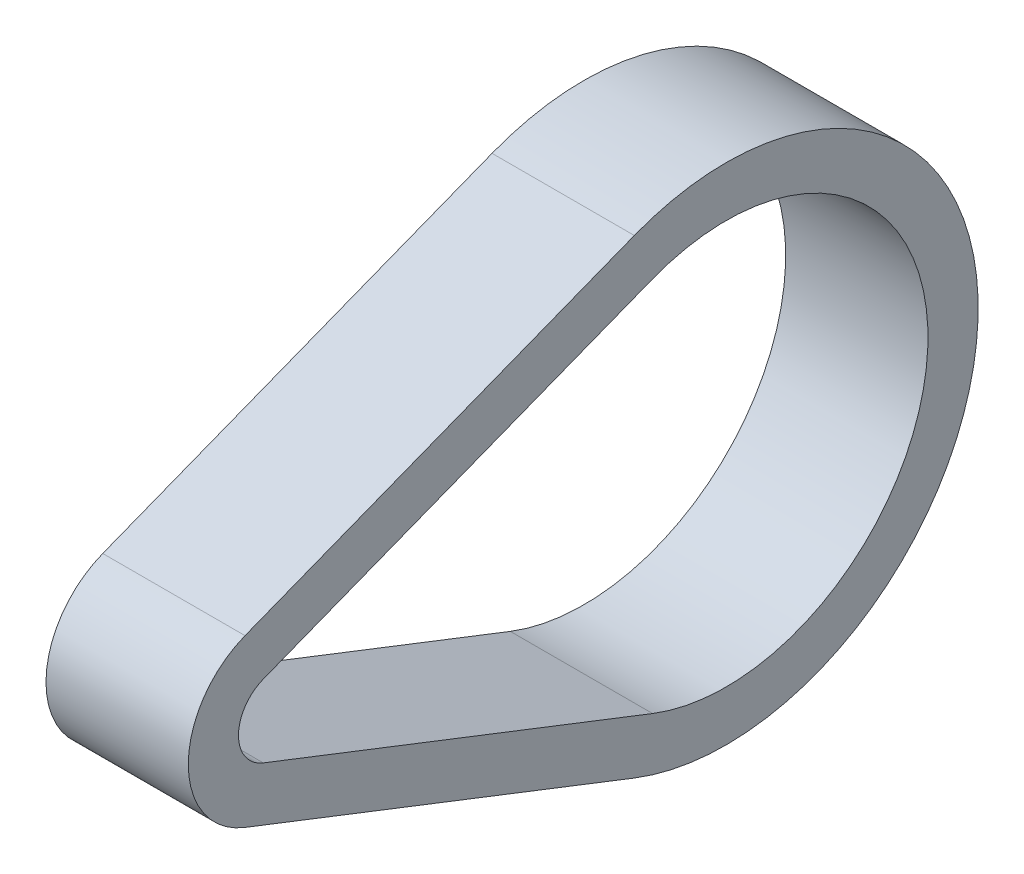
ISO-10303-21;
HEADER;
FILE_DESCRIPTION(('STEP AP214'),'2;1');
FILE_NAME('part.step','',(''),(''),'','','');
FILE_SCHEMA(('AUTOMOTIVE_DESIGN { 1 0 10303 214 1 1 1 1 }'));
ENDSEC;
DATA;
#1=APPLICATION_CONTEXT('core data for automotive mechanical design processes');
#2=APPLICATION_PROTOCOL_DEFINITION('international standard','automotive_design',2000,#1);
#3=PRODUCT_CONTEXT('',#1,'mechanical');
#4=PRODUCT('Part','Part','',(#3));
#5=PRODUCT_RELATED_PRODUCT_CATEGORY('part','',(#4));
#6=PRODUCT_DEFINITION_FORMATION('','',#4);
#7=PRODUCT_DEFINITION_CONTEXT('part definition',#1,'design');
#8=PRODUCT_DEFINITION('design','',#6,#7);
#9=PRODUCT_DEFINITION_SHAPE('','',#8);
#10=(LENGTH_UNIT() NAMED_UNIT(*) SI_UNIT(.MILLI.,.METRE.));
#11=(NAMED_UNIT(*) PLANE_ANGLE_UNIT() SI_UNIT($,.RADIAN.));
#12=(NAMED_UNIT(*) SI_UNIT($,.STERADIAN.) SOLID_ANGLE_UNIT());
#13=UNCERTAINTY_MEASURE_WITH_UNIT(LENGTH_MEASURE(1.E-05),#10,'distance_accuracy_value','');
#14=(GEOMETRIC_REPRESENTATION_CONTEXT(3) GLOBAL_UNCERTAINTY_ASSIGNED_CONTEXT((#13)) GLOBAL_UNIT_ASSIGNED_CONTEXT((#10,
#11,#12)) REPRESENTATION_CONTEXT('',''));
#15=CARTESIAN_POINT('',(0.,0.,0.));
#16=DIRECTION('',(0.,0.,1.));
#17=DIRECTION('',(1.,0.,0.));
#18=AXIS2_PLACEMENT_3D('',#15,#16,#17);
#19=CARTESIAN_POINT('',(4.5,0.,0.));
#20=DIRECTION('',(1.,0.,0.));
#21=DIRECTION('',(0.,0.,-1.));
#22=AXIS2_PLACEMENT_3D('',#19,#20,#21);
#23=PLANE('',#22);
#24=CARTESIAN_POINT('',(4.5,0.,0.));
#25=DIRECTION('',(1.,0.,0.));
#26=DIRECTION('',(0.,0.,-1.));
#27=AXIS2_PLACEMENT_3D('',#24,#25,#26);
#28=CIRCLE('',#27,5.6388);
#29=CARTESIAN_POINT('',(4.5,5.25313146964657,2.04955487914056));
#30=VERTEX_POINT('',#29);
#31=CARTESIAN_POINT('',(4.5,-5.25313146964657,2.04955487914055));
#32=VERTEX_POINT('',#31);
#33=EDGE_CURVE('E153',#30,#32,#28,.T.);
#34=ORIENTED_EDGE('',*,*,#33,.T.);
#35=DIRECTION('',(0.,-0.363473589973142,-0.931604502668399));
#36=VECTOR('',#35,1.);
#37=CARTESIAN_POINT('',(4.5,-5.25313146964657,2.04955487914055));
#38=LINE('',#37,#36);
#39=CARTESIAN_POINT('',(4.5,-14.8602097429642,-22.5739600716204));
#40=VERTEX_POINT('',#39);
#41=EDGE_CURVE('E157',#32,#40,#38,.T.);
#42=ORIENTED_EDGE('',*,*,#41,.T.);
#43=CARTESIAN_POINT('',(4.5,0.,-28.3718));
#44=DIRECTION('',(1.,0.,0.));
#45=DIRECTION('',(0.,0.,-1.));
#46=AXIS2_PLACEMENT_3D('',#43,#44,#45);
#47=CIRCLE('',#46,15.9512);
#48=CARTESIAN_POINT('',(4.5,14.8602097429642,-22.5739600716204));
#49=VERTEX_POINT('',#48);
#50=EDGE_CURVE('E161',#40,#49,#47,.T.);
#51=ORIENTED_EDGE('',*,*,#50,.T.);
#52=DIRECTION('',(0.,-0.363473589973142,0.9316045026684));
#53=VECTOR('',#52,1.);
#54=CARTESIAN_POINT('',(4.5,5.25313146964657,2.04955487914056));
#55=LINE('',#54,#53);
#56=EDGE_CURVE('E164',#49,#30,#55,.T.);
#57=ORIENTED_EDGE('',*,*,#56,.T.);
#58=EDGE_LOOP('',(#34,#42,#51,#57));
#59=FACE_BOUND('',#58,.T.);
#60=DIRECTION('',(0.,-0.363473589973142,-0.9316045026684));
#61=VECTOR('',#60,1.);
#62=CARTESIAN_POINT('',(4.5,-2.2952871736744,0.895526230975828));
#63=LINE('',#62,#61);
#64=CARTESIAN_POINT('',(4.5,-2.2952871736744,0.895526230975828));
#65=VERTEX_POINT('',#64);
#66=CARTESIAN_POINT('',(4.5,-11.902365446992,-23.7279887197851));
#67=VERTEX_POINT('',#66);
#68=EDGE_CURVE('E114',#65,#67,#63,.T.);
#69=ORIENTED_EDGE('',*,*,#68,.F.);
#70=CARTESIAN_POINT('',(4.5,0.,0.));
#71=DIRECTION('',(1.,0.,0.));
#72=DIRECTION('',(0.,0.,-1.));
#73=AXIS2_PLACEMENT_3D('',#70,#71,#72);
#74=CIRCLE('',#73,2.4638);
#75=CARTESIAN_POINT('',(4.5,2.2952871736744,0.895526230975828));
#76=VERTEX_POINT('',#75);
#77=EDGE_CURVE('E105',#76,#65,#74,.T.);
#78=ORIENTED_EDGE('',*,*,#77,.F.);
#79=DIRECTION('',(0.,-0.363473589973142,0.9316045026684));
#80=VECTOR('',#79,1.);
#81=CARTESIAN_POINT('',(4.5,2.2952871736744,0.895526230975828));
#82=LINE('',#81,#80);
#83=CARTESIAN_POINT('',(4.5,11.902365446992,-23.7279887197851));
#84=VERTEX_POINT('',#83);
#85=EDGE_CURVE('E131',#84,#76,#82,.T.);
#86=ORIENTED_EDGE('',*,*,#85,.F.);
#87=CARTESIAN_POINT('',(4.5,0.,-28.3718));
#88=DIRECTION('',(1.,0.,0.));
#89=DIRECTION('',(0.,0.,-1.));
#90=AXIS2_PLACEMENT_3D('',#87,#88,#89);
#91=CIRCLE('',#90,12.7762);
#92=EDGE_CURVE('E127',#67,#84,#91,.T.);
#93=ORIENTED_EDGE('',*,*,#92,.F.);
#94=EDGE_LOOP('',(#69,#78,#86,#93));
#95=FACE_BOUND('',#94,.T.);
#96=ADVANCED_FACE('F39',(#59,#95),#23,.T.);
#97=CARTESIAN_POINT('',(-4.5,0.,0.));
#98=DIRECTION('',(1.,0.,0.));
#99=DIRECTION('',(0.,0.,-1.));
#100=AXIS2_PLACEMENT_3D('',#97,#98,#99);
#101=PLANE('',#100);
#102=CARTESIAN_POINT('',(-4.5,0.,0.));
#103=DIRECTION('',(1.,0.,0.));
#104=DIRECTION('',(0.,0.,-1.));
#105=AXIS2_PLACEMENT_3D('',#102,#103,#104);
#106=CIRCLE('',#105,5.6388);
#107=CARTESIAN_POINT('',(-4.5,5.25313146964657,2.04955487914056));
#108=VERTEX_POINT('',#107);
#109=CARTESIAN_POINT('',(-4.5,-5.25313146964657,2.04955487914055));
#110=VERTEX_POINT('',#109);
#111=EDGE_CURVE('E123',#108,#110,#106,.T.);
#112=ORIENTED_EDGE('',*,*,#111,.F.);
#113=DIRECTION('',(0.,-0.363473589973142,0.9316045026684));
#114=VECTOR('',#113,1.);
#115=CARTESIAN_POINT('',(-4.5,5.25313146964657,2.04955487914056));
#116=LINE('',#115,#114);
#117=CARTESIAN_POINT('',(-4.5,14.8602097429642,-22.5739600716204));
#118=VERTEX_POINT('',#117);
#119=EDGE_CURVE('E158',#118,#108,#116,.T.);
#120=ORIENTED_EDGE('',*,*,#119,.F.);
#121=CARTESIAN_POINT('',(-4.5,0.,-28.3718));
#122=DIRECTION('',(1.,0.,0.));
#123=DIRECTION('',(0.,0.,-1.));
#124=AXIS2_PLACEMENT_3D('',#121,#122,#123);
#125=CIRCLE('',#124,15.9512);
#126=CARTESIAN_POINT('',(-4.5,-14.8602097429642,-22.5739600716204));
#127=VERTEX_POINT('',#126);
#128=EDGE_CURVE('E174',#127,#118,#125,.T.);
#129=ORIENTED_EDGE('',*,*,#128,.F.);
#130=DIRECTION('',(0.,-0.363473589973142,-0.931604502668399));
#131=VECTOR('',#130,1.);
#132=CARTESIAN_POINT('',(-4.5,-5.25313146964657,2.04955487914055));
#133=LINE('',#132,#131);
#134=EDGE_CURVE('E171',#110,#127,#133,.T.);
#135=ORIENTED_EDGE('',*,*,#134,.F.);
#136=EDGE_LOOP('',(#112,#120,#129,#135));
#137=FACE_BOUND('',#136,.T.);
#138=CARTESIAN_POINT('',(-4.5,0.,0.));
#139=DIRECTION('',(1.,0.,0.));
#140=DIRECTION('',(0.,0.,-1.));
#141=AXIS2_PLACEMENT_3D('',#138,#139,#140);
#142=CIRCLE('',#141,2.4638);
#143=CARTESIAN_POINT('',(-4.5,2.2952871736744,0.895526230975828));
#144=VERTEX_POINT('',#143);
#145=CARTESIAN_POINT('',(-4.5,-2.2952871736744,0.895526230975828));
#146=VERTEX_POINT('',#145);
#147=EDGE_CURVE('E63',#144,#146,#142,.T.);
#148=ORIENTED_EDGE('',*,*,#147,.T.);
#149=DIRECTION('',(0.,-0.363473589973142,-0.9316045026684));
#150=VECTOR('',#149,1.);
#151=CARTESIAN_POINT('',(-4.5,-2.2952871736744,0.895526230975828));
#152=LINE('',#151,#150);
#153=CARTESIAN_POINT('',(-4.5,-11.902365446992,-23.7279887197851));
#154=VERTEX_POINT('',#153);
#155=EDGE_CURVE('E121',#146,#154,#152,.T.);
#156=ORIENTED_EDGE('',*,*,#155,.T.);
#157=CARTESIAN_POINT('',(-4.5,0.,-28.3718));
#158=DIRECTION('',(1.,0.,0.));
#159=DIRECTION('',(0.,0.,-1.));
#160=AXIS2_PLACEMENT_3D('',#157,#158,#159);
#161=CIRCLE('',#160,12.7762);
#162=CARTESIAN_POINT('',(-4.5,11.902365446992,-23.7279887197851));
#163=VERTEX_POINT('',#162);
#164=EDGE_CURVE('E140',#154,#163,#161,.T.);
#165=ORIENTED_EDGE('',*,*,#164,.T.);
#166=DIRECTION('',(0.,-0.363473589973142,0.9316045026684));
#167=VECTOR('',#166,1.);
#168=CARTESIAN_POINT('',(-4.5,2.2952871736744,0.895526230975828));
#169=LINE('',#168,#167);
#170=EDGE_CURVE('E115',#163,#144,#169,.T.);
#171=ORIENTED_EDGE('',*,*,#170,.T.);
#172=EDGE_LOOP('',(#148,#156,#165,#171));
#173=FACE_BOUND('',#172,.T.);
#174=ADVANCED_FACE('F197',(#137,#173),#101,.F.);
#175=CARTESIAN_POINT('',(4.5,0.,0.));
#176=DIRECTION('',(-1.,0.,0.));
#177=DIRECTION('',(0.,0.,1.));
#178=AXIS2_PLACEMENT_3D('',#175,#176,#177);
#179=CYLINDRICAL_SURFACE('',#178,5.6388);
#180=ORIENTED_EDGE('',*,*,#111,.T.);
#181=DIRECTION('',(-1.,0.,0.));
#182=VECTOR('',#181,1.);
#183=CARTESIAN_POINT('',(4.5,-5.25313146964657,2.04955487914055));
#184=LINE('',#183,#182);
#185=EDGE_CURVE('E11',#32,#110,#184,.T.);
#186=ORIENTED_EDGE('',*,*,#185,.F.);
#187=ORIENTED_EDGE('',*,*,#33,.F.);
#188=DIRECTION('',(-1.,0.,0.));
#189=VECTOR('',#188,1.);
#190=CARTESIAN_POINT('',(4.5,5.25313146964657,2.04955487914056));
#191=LINE('',#190,#189);
#192=EDGE_CURVE('E167',#30,#108,#191,.T.);
#193=ORIENTED_EDGE('',*,*,#192,.T.);
#194=EDGE_LOOP('',(#180,#186,#187,#193));
#195=FACE_BOUND('',#194,.T.);
#196=ADVANCED_FACE('F41',(#195),#179,.T.);
#197=CARTESIAN_POINT('',(4.5,-5.25313146964657,2.04955487914055));
#198=DIRECTION('',(0.,0.931604502668399,-0.363473589973142));
#199=DIRECTION('',(0.,0.363473589973142,0.931604502668399));
#200=AXIS2_PLACEMENT_3D('',#197,#198,#199);
#201=PLANE('',#200);
#202=ORIENTED_EDGE('',*,*,#134,.T.);
#203=DIRECTION('',(-1.,0.,0.));
#204=VECTOR('',#203,1.);
#205=CARTESIAN_POINT('',(4.5,-14.8602097429642,-22.5739600716204));
#206=LINE('',#205,#204);
#207=EDGE_CURVE('E48',#40,#127,#206,.T.);
#208=ORIENTED_EDGE('',*,*,#207,.F.);
#209=ORIENTED_EDGE('',*,*,#41,.F.);
#210=ORIENTED_EDGE('',*,*,#185,.T.);
#211=EDGE_LOOP('',(#202,#208,#209,#210));
#212=FACE_BOUND('',#211,.T.);
#213=ADVANCED_FACE('F207',(#212),#201,.F.);
#214=CARTESIAN_POINT('',(4.5,0.,-28.3718));
#215=DIRECTION('',(-1.,0.,0.));
#216=DIRECTION('',(0.,0.,1.));
#217=AXIS2_PLACEMENT_3D('',#214,#215,#216);
#218=CYLINDRICAL_SURFACE('',#217,15.9512);
#219=ORIENTED_EDGE('',*,*,#128,.T.);
#220=DIRECTION('',(-1.,0.,0.));
#221=VECTOR('',#220,1.);
#222=CARTESIAN_POINT('',(4.5,14.8602097429642,-22.5739600716204));
#223=LINE('',#222,#221);
#224=EDGE_CURVE('E182',#49,#118,#223,.T.);
#225=ORIENTED_EDGE('',*,*,#224,.F.);
#226=ORIENTED_EDGE('',*,*,#50,.F.);
#227=ORIENTED_EDGE('',*,*,#207,.T.);
#228=EDGE_LOOP('',(#219,#225,#226,#227));
#229=FACE_BOUND('',#228,.T.);
#230=ADVANCED_FACE('F191',(#229),#218,.T.);
#231=CARTESIAN_POINT('',(4.5,5.25313146964657,2.04955487914056));
#232=DIRECTION('',(0.,-0.931604502668399,-0.363473589973142));
#233=DIRECTION('',(0.,0.363473589973142,-0.931604502668399));
#234=AXIS2_PLACEMENT_3D('',#231,#232,#233);
#235=PLANE('',#234);
#236=ORIENTED_EDGE('',*,*,#119,.T.);
#237=ORIENTED_EDGE('',*,*,#192,.F.);
#238=ORIENTED_EDGE('',*,*,#56,.F.);
#239=ORIENTED_EDGE('',*,*,#224,.T.);
#240=EDGE_LOOP('',(#236,#237,#238,#239));
#241=FACE_BOUND('',#240,.T.);
#242=ADVANCED_FACE('F201',(#241),#235,.F.);
#243=CARTESIAN_POINT('',(4.5,0.,0.));
#244=DIRECTION('',(-1.,0.,0.));
#245=DIRECTION('',(0.,0.,1.));
#246=AXIS2_PLACEMENT_3D('',#243,#244,#245);
#247=CYLINDRICAL_SURFACE('',#246,2.4638);
#248=ORIENTED_EDGE('',*,*,#147,.F.);
#249=DIRECTION('',(-1.,0.,0.));
#250=VECTOR('',#249,1.);
#251=CARTESIAN_POINT('',(4.5,2.2952871736744,0.895526230975828));
#252=LINE('',#251,#250);
#253=EDGE_CURVE('E109',#76,#144,#252,.T.);
#254=ORIENTED_EDGE('',*,*,#253,.F.);
#255=ORIENTED_EDGE('',*,*,#77,.T.);
#256=DIRECTION('',(-1.,0.,0.));
#257=VECTOR('',#256,1.);
#258=CARTESIAN_POINT('',(4.5,-2.2952871736744,0.895526230975828));
#259=LINE('',#258,#257);
#260=EDGE_CURVE('E108',#65,#146,#259,.T.);
#261=ORIENTED_EDGE('',*,*,#260,.T.);
#262=EDGE_LOOP('',(#248,#254,#255,#261));
#263=FACE_BOUND('',#262,.T.);
#264=ADVANCED_FACE('F107',(#263),#247,.F.);
#265=CARTESIAN_POINT('',(4.5,-2.2952871736744,0.895526230975828));
#266=DIRECTION('',(0.,0.931604502668399,-0.363473589973142));
#267=DIRECTION('',(0.,0.363473589973142,0.9316045026684));
#268=AXIS2_PLACEMENT_3D('',#265,#266,#267);
#269=PLANE('',#268);
#270=ORIENTED_EDGE('',*,*,#155,.F.);
#271=ORIENTED_EDGE('',*,*,#260,.F.);
#272=ORIENTED_EDGE('',*,*,#68,.T.);
#273=DIRECTION('',(-1.,0.,0.));
#274=VECTOR('',#273,1.);
#275=CARTESIAN_POINT('',(4.5,-11.902365446992,-23.7279887197851));
#276=LINE('',#275,#274);
#277=EDGE_CURVE('E124',#67,#154,#276,.T.);
#278=ORIENTED_EDGE('',*,*,#277,.T.);
#279=EDGE_LOOP('',(#270,#271,#272,#278));
#280=FACE_BOUND('',#279,.T.);
#281=ADVANCED_FACE('F118',(#280),#269,.T.);
#282=CARTESIAN_POINT('',(4.5,0.,-28.3718));
#283=DIRECTION('',(-1.,0.,0.));
#284=DIRECTION('',(0.,0.,1.));
#285=AXIS2_PLACEMENT_3D('',#282,#283,#284);
#286=CYLINDRICAL_SURFACE('',#285,12.7762);
#287=ORIENTED_EDGE('',*,*,#164,.F.);
#288=ORIENTED_EDGE('',*,*,#277,.F.);
#289=ORIENTED_EDGE('',*,*,#92,.T.);
#290=DIRECTION('',(-1.,0.,0.));
#291=VECTOR('',#290,1.);
#292=CARTESIAN_POINT('',(4.5,11.902365446992,-23.7279887197851));
#293=LINE('',#292,#291);
#294=EDGE_CURVE('E55',#84,#163,#293,.T.);
#295=ORIENTED_EDGE('',*,*,#294,.T.);
#296=EDGE_LOOP('',(#287,#288,#289,#295));
#297=FACE_BOUND('',#296,.T.);
#298=ADVANCED_FACE('F230',(#297),#286,.F.);
#299=CARTESIAN_POINT('',(4.5,2.2952871736744,0.895526230975828));
#300=DIRECTION('',(0.,-0.931604502668399,-0.363473589973142));
#301=DIRECTION('',(0.,0.363473589973142,-0.9316045026684));
#302=AXIS2_PLACEMENT_3D('',#299,#300,#301);
#303=PLANE('',#302);
#304=ORIENTED_EDGE('',*,*,#170,.F.);
#305=ORIENTED_EDGE('',*,*,#294,.F.);
#306=ORIENTED_EDGE('',*,*,#85,.T.);
#307=ORIENTED_EDGE('',*,*,#253,.T.);
#308=EDGE_LOOP('',(#304,#305,#306,#307));
#309=FACE_BOUND('',#308,.T.);
#310=ADVANCED_FACE('F234',(#309),#303,.T.);
#311=CLOSED_SHELL('',(#96,#174,#196,#213,#230,#242,#264,#281,#298,#310));
#312=MANIFOLD_SOLID_BREP('B2',#311);
#313=ADVANCED_BREP_SHAPE_REPRESENTATION('',(#18,#312),#14);
#314=SHAPE_DEFINITION_REPRESENTATION(#9,#313);
ENDSEC;
END-ISO-10303-21;
